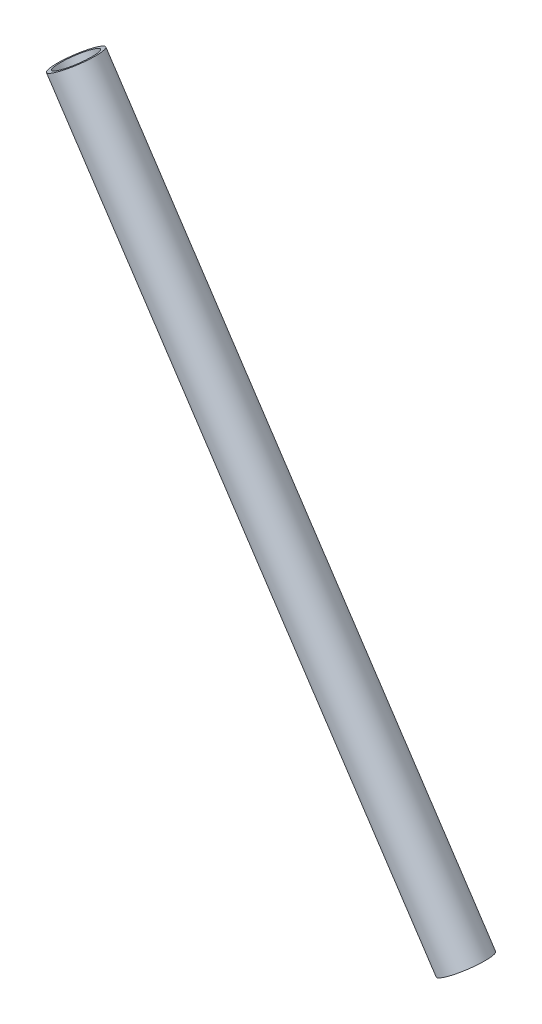
ISO-10303-21;
HEADER;
FILE_DESCRIPTION(('STEP AP214'),'2;1');
FILE_NAME('part.step','',(''),(''),'','','');
FILE_SCHEMA(('AUTOMOTIVE_DESIGN { 1 0 10303 214 1 1 1 1 }'));
ENDSEC;
DATA;
#1=APPLICATION_CONTEXT('core data for automotive mechanical design processes');
#2=APPLICATION_PROTOCOL_DEFINITION('international standard','automotive_design',2000,#1);
#3=PRODUCT_CONTEXT('',#1,'mechanical');
#4=PRODUCT('Part','Part','',(#3));
#5=PRODUCT_RELATED_PRODUCT_CATEGORY('part','',(#4));
#6=PRODUCT_DEFINITION_FORMATION('','',#4);
#7=PRODUCT_DEFINITION_CONTEXT('part definition',#1,'design');
#8=PRODUCT_DEFINITION('design','',#6,#7);
#9=PRODUCT_DEFINITION_SHAPE('','',#8);
#10=(LENGTH_UNIT() NAMED_UNIT(*) SI_UNIT(.MILLI.,.METRE.));
#11=(NAMED_UNIT(*) PLANE_ANGLE_UNIT() SI_UNIT($,.RADIAN.));
#12=(NAMED_UNIT(*) SI_UNIT($,.STERADIAN.) SOLID_ANGLE_UNIT());
#13=UNCERTAINTY_MEASURE_WITH_UNIT(LENGTH_MEASURE(1.E-05),#10,'distance_accuracy_value','');
#14=(GEOMETRIC_REPRESENTATION_CONTEXT(3) GLOBAL_UNCERTAINTY_ASSIGNED_CONTEXT((#13)) GLOBAL_UNIT_ASSIGNED_CONTEXT((#10,
#11,#12)) REPRESENTATION_CONTEXT('',''));
#15=CARTESIAN_POINT('',(0.,0.,0.));
#16=DIRECTION('',(0.,0.,1.));
#17=DIRECTION('',(1.,0.,0.));
#18=AXIS2_PLACEMENT_3D('',#15,#16,#17);
#19=CARTESIAN_POINT('',(317.484207445408,618.250966312594,0.));
#20=DIRECTION('',(-0.552207040137205,0.833707013778166,0.));
#21=DIRECTION('',(-0.833707013778166,-0.552207040137205,0.));
#22=AXIS2_PLACEMENT_3D('',#19,#20,#21);
#23=CYLINDRICAL_SURFACE('',#22,7.87399999999998);
#24=CARTESIAN_POINT('',(317.484207445408,618.250966312594,0.));
#25=DIRECTION('',(-0.552207040137205,0.833707013778166,0.));
#26=DIRECTION('',(-0.833707013778166,-0.552207040137205,0.));
#27=AXIS2_PLACEMENT_3D('',#24,#25,#26);
#28=CIRCLE('',#27,7.87400000000004);
#29=CARTESIAN_POINT('',(310.919598418918,613.902888078554,0.));
#30=VERTEX_POINT('',#29);
#31=EDGE_CURVE('E47',#30,#30,#28,.T.);
#32=ORIENTED_EDGE('',*,*,#31,.T.);
#33=EDGE_LOOP('',(#32));
#34=FACE_BOUND('',#33,.T.);
#35=CARTESIAN_POINT('',(479.69417677287,373.350812378583,0.));
#36=DIRECTION('',(-0.552207040137205,0.833707013778166,0.));
#37=DIRECTION('',(-0.833707013778166,-0.552207040137205,0.));
#38=AXIS2_PLACEMENT_3D('',#35,#36,#37);
#39=CIRCLE('',#38,7.87399999999991);
#40=CARTESIAN_POINT('',(473.129567746381,369.002734144543,0.));
#41=VERTEX_POINT('',#40);
#42=EDGE_CURVE('E10',#41,#41,#39,.T.);
#43=ORIENTED_EDGE('',*,*,#42,.F.);
#44=EDGE_LOOP('',(#43));
#45=FACE_BOUND('',#44,.T.);
#46=ADVANCED_FACE('F33',(#34,#45),#23,.F.);
#47=CARTESIAN_POINT('',(473.12956774638,369.002734144543,0.));
#48=DIRECTION('',(0.552207040137205,-0.833707013778166,0.));
#49=DIRECTION('',(0.833707013778166,0.552207040137205,0.));
#50=AXIS2_PLACEMENT_3D('',#47,#48,#49);
#51=PLANE('',#50);
#52=ORIENTED_EDGE('',*,*,#42,.T.);
#53=EDGE_LOOP('',(#52));
#54=FACE_BOUND('',#53,.T.);
#55=CARTESIAN_POINT('',(479.69417677287,373.350812378583,0.));
#56=DIRECTION('',(-0.552207040137205,0.833707013778166,0.));
#57=DIRECTION('',(-0.833707013778166,-0.552207040137205,0.));
#58=AXIS2_PLACEMENT_3D('',#55,#56,#57);
#59=CIRCLE('',#58,9.52499999999998);
#60=CARTESIAN_POINT('',(471.753117466633,368.091040321276,0.));
#61=VERTEX_POINT('',#60);
#62=EDGE_CURVE('E39',#61,#61,#59,.T.);
#63=ORIENTED_EDGE('',*,*,#62,.F.);
#64=EDGE_LOOP('',(#63));
#65=FACE_BOUND('',#64,.T.);
#66=ADVANCED_FACE('F63',(#54,#65),#51,.T.);
#67=CARTESIAN_POINT('',(317.484207445408,618.250966312594,0.));
#68=DIRECTION('',(-0.552207040137205,0.833707013778166,0.));
#69=DIRECTION('',(-0.833707013778166,-0.552207040137205,0.));
#70=AXIS2_PLACEMENT_3D('',#67,#68,#69);
#71=CYLINDRICAL_SURFACE('',#70,9.52500000000001);
#72=ORIENTED_EDGE('',*,*,#62,.T.);
#73=EDGE_LOOP('',(#72));
#74=FACE_BOUND('',#73,.T.);
#75=CARTESIAN_POINT('',(317.484207445408,618.250966312594,0.));
#76=DIRECTION('',(-0.552207040137205,0.833707013778166,0.));
#77=DIRECTION('',(-0.833707013778166,-0.552207040137205,0.));
#78=AXIS2_PLACEMENT_3D('',#75,#76,#77);
#79=CIRCLE('',#78,9.52500000000003);
#80=CARTESIAN_POINT('',(309.543148139171,612.991194255287,0.));
#81=VERTEX_POINT('',#80);
#82=EDGE_CURVE('E43',#81,#81,#79,.T.);
#83=ORIENTED_EDGE('',*,*,#82,.F.);
#84=EDGE_LOOP('',(#83));
#85=FACE_BOUND('',#84,.T.);
#86=ADVANCED_FACE('F57',(#74,#85),#71,.T.);
#87=CARTESIAN_POINT('',(309.543148139171,612.991194255287,0.));
#88=DIRECTION('',(-0.552207040137205,0.833707013778166,0.));
#89=DIRECTION('',(-0.833707013778166,-0.552207040137205,0.));
#90=AXIS2_PLACEMENT_3D('',#87,#88,#89);
#91=PLANE('',#90);
#92=ORIENTED_EDGE('',*,*,#82,.T.);
#93=EDGE_LOOP('',(#92));
#94=FACE_BOUND('',#93,.T.);
#95=ORIENTED_EDGE('',*,*,#31,.F.);
#96=EDGE_LOOP('',(#95));
#97=FACE_BOUND('',#96,.T.);
#98=ADVANCED_FACE('F55',(#94,#97),#91,.T.);
#99=CLOSED_SHELL('',(#46,#66,#86,#98));
#100=MANIFOLD_SOLID_BREP('B2',#99);
#101=ADVANCED_BREP_SHAPE_REPRESENTATION('',(#18,#100),#14);
#102=SHAPE_DEFINITION_REPRESENTATION(#9,#101);
ENDSEC;
END-ISO-10303-21;
